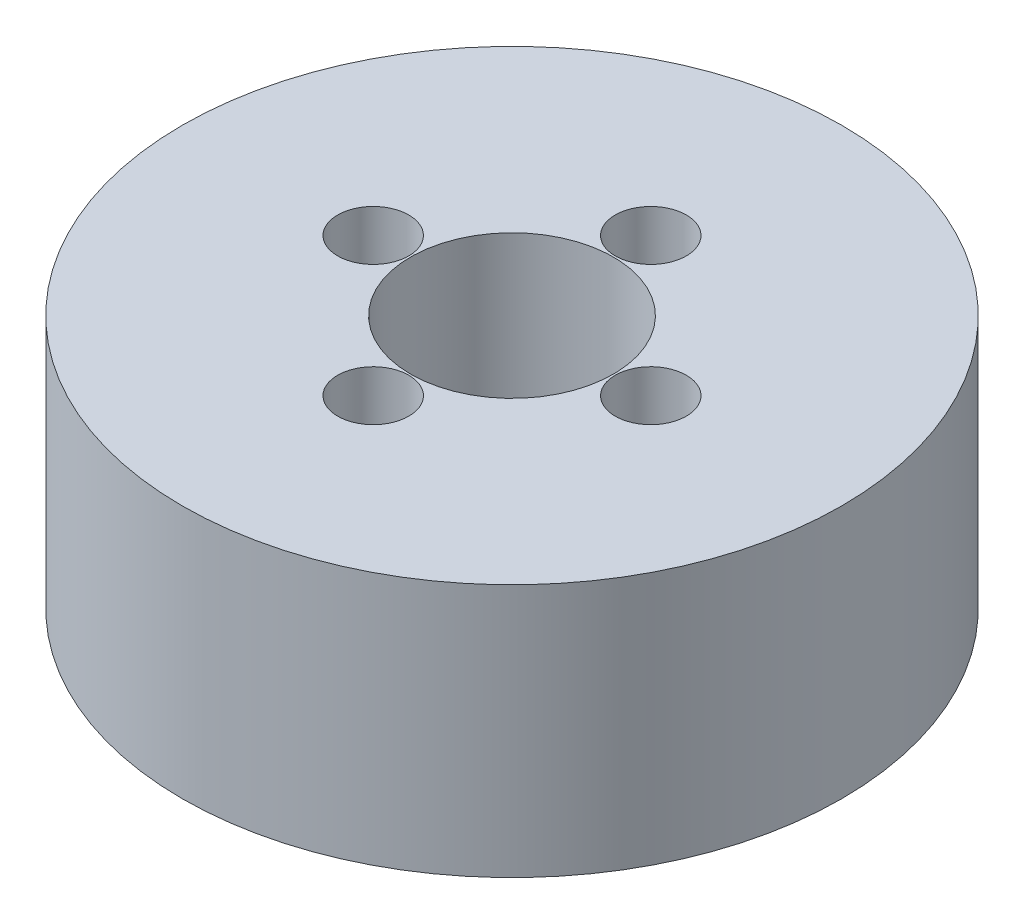
ISO-10303-21;
HEADER;
FILE_DESCRIPTION(('STEP AP214'),'2;1');
FILE_NAME('part.step','',(''),(''),'','','');
FILE_SCHEMA(('AUTOMOTIVE_DESIGN { 1 0 10303 214 1 1 1 1 }'));
ENDSEC;
DATA;
#1=APPLICATION_CONTEXT('core data for automotive mechanical design processes');
#2=APPLICATION_PROTOCOL_DEFINITION('international standard','automotive_design',2000,#1);
#3=PRODUCT_CONTEXT('',#1,'mechanical');
#4=PRODUCT('Part','Part','',(#3));
#5=PRODUCT_RELATED_PRODUCT_CATEGORY('part','',(#4));
#6=PRODUCT_DEFINITION_FORMATION('','',#4);
#7=PRODUCT_DEFINITION_CONTEXT('part definition',#1,'design');
#8=PRODUCT_DEFINITION('design','',#6,#7);
#9=PRODUCT_DEFINITION_SHAPE('','',#8);
#10=(LENGTH_UNIT() NAMED_UNIT(*) SI_UNIT(.MILLI.,.METRE.));
#11=(NAMED_UNIT(*) PLANE_ANGLE_UNIT() SI_UNIT($,.RADIAN.));
#12=(NAMED_UNIT(*) SI_UNIT($,.STERADIAN.) SOLID_ANGLE_UNIT());
#13=UNCERTAINTY_MEASURE_WITH_UNIT(LENGTH_MEASURE(1.E-05),#10,'distance_accuracy_value','');
#14=(GEOMETRIC_REPRESENTATION_CONTEXT(3) GLOBAL_UNCERTAINTY_ASSIGNED_CONTEXT((#13)) GLOBAL_UNIT_ASSIGNED_CONTEXT((#10,
#11,#12)) REPRESENTATION_CONTEXT('',''));
#15=CARTESIAN_POINT('',(0.,0.,0.));
#16=DIRECTION('',(0.,0.,1.));
#17=DIRECTION('',(1.,0.,0.));
#18=AXIS2_PLACEMENT_3D('',#15,#16,#17);
#19=CARTESIAN_POINT('',(0.,25.,0.));
#20=DIRECTION('',(0.,-1.,0.));
#21=DIRECTION('',(0.,0.,-1.));
#22=AXIS2_PLACEMENT_3D('',#19,#20,#21);
#23=CYLINDRICAL_SURFACE('',#22,32.5);
#24=CARTESIAN_POINT('',(0.,25.,0.));
#25=DIRECTION('',(0.,1.,0.));
#26=DIRECTION('',(0.,0.,1.));
#27=AXIS2_PLACEMENT_3D('',#24,#25,#26);
#28=CIRCLE('',#27,32.5);
#29=CARTESIAN_POINT('',(0.,25.,32.5));
#30=VERTEX_POINT('',#29);
#31=EDGE_CURVE('E10',#30,#30,#28,.T.);
#32=ORIENTED_EDGE('',*,*,#31,.F.);
#33=EDGE_LOOP('',(#32));
#34=FACE_BOUND('',#33,.T.);
#35=CARTESIAN_POINT('',(0.,0.,0.));
#36=DIRECTION('',(0.,1.,0.));
#37=DIRECTION('',(0.,0.,1.));
#38=AXIS2_PLACEMENT_3D('',#35,#36,#37);
#39=CIRCLE('',#38,32.5);
#40=CARTESIAN_POINT('',(0.,0.,32.5));
#41=VERTEX_POINT('',#40);
#42=EDGE_CURVE('E37',#41,#41,#39,.T.);
#43=ORIENTED_EDGE('',*,*,#42,.T.);
#44=EDGE_LOOP('',(#43));
#45=FACE_BOUND('',#44,.T.);
#46=ADVANCED_FACE('F40',(#34,#45),#23,.T.);
#47=CARTESIAN_POINT('',(0.,25.,0.));
#48=DIRECTION('',(0.,1.,0.));
#49=DIRECTION('',(0.,0.,1.));
#50=AXIS2_PLACEMENT_3D('',#47,#48,#49);
#51=PLANE('',#50);
#52=CARTESIAN_POINT('',(0.,25.,13.680179401464));
#53=DIRECTION('',(0.,1.,0.));
#54=DIRECTION('',(1.,0.,0.));
#55=AXIS2_PLACEMENT_3D('',#52,#53,#54);
#56=CIRCLE('',#55,3.50239896659175);
#57=CARTESIAN_POINT('',(3.5023989665918,25.,13.680179401464));
#58=VERTEX_POINT('',#57);
#59=EDGE_CURVE('E71',#58,#58,#56,.T.);
#60=ORIENTED_EDGE('',*,*,#59,.F.);
#61=EDGE_LOOP('',(#60));
#62=FACE_BOUND('',#61,.T.);
#63=CARTESIAN_POINT('',(13.680179401464,25.,0.));
#64=DIRECTION('',(0.,1.,0.));
#65=DIRECTION('',(0.,0.,-1.));
#66=AXIS2_PLACEMENT_3D('',#63,#64,#65);
#67=CIRCLE('',#66,3.50239896659175);
#68=CARTESIAN_POINT('',(13.680179401464,25.,-3.50239896659175));
#69=VERTEX_POINT('',#68);
#70=EDGE_CURVE('E70',#69,#69,#67,.T.);
#71=ORIENTED_EDGE('',*,*,#70,.F.);
#72=EDGE_LOOP('',(#71));
#73=FACE_BOUND('',#72,.T.);
#74=CARTESIAN_POINT('',(-1.43292273276713E-13,25.,-13.680179401464));
#75=DIRECTION('',(0.,1.,0.));
#76=DIRECTION('',(-1.,0.,0.));
#77=AXIS2_PLACEMENT_3D('',#74,#75,#76);
#78=CIRCLE('',#77,3.50239896659175);
#79=CARTESIAN_POINT('',(-3.5023989665919,25.,-13.680179401464));
#80=VERTEX_POINT('',#79);
#81=EDGE_CURVE('E61',#80,#80,#78,.T.);
#82=ORIENTED_EDGE('',*,*,#81,.F.);
#83=EDGE_LOOP('',(#82));
#84=FACE_BOUND('',#83,.T.);
#85=CARTESIAN_POINT('',(-13.680179401464,25.,0.));
#86=DIRECTION('',(0.,1.,0.));
#87=DIRECTION('',(0.,0.,1.));
#88=AXIS2_PLACEMENT_3D('',#85,#86,#87);
#89=CIRCLE('',#88,3.50239896659175);
#90=CARTESIAN_POINT('',(-13.680179401464,25.,3.50239896659175));
#91=VERTEX_POINT('',#90);
#92=EDGE_CURVE('E54',#91,#91,#89,.T.);
#93=ORIENTED_EDGE('',*,*,#92,.F.);
#94=EDGE_LOOP('',(#93));
#95=FACE_BOUND('',#94,.T.);
#96=CARTESIAN_POINT('',(0.,25.,0.));
#97=DIRECTION('',(0.,1.,0.));
#98=DIRECTION('',(0.,0.,1.));
#99=AXIS2_PLACEMENT_3D('',#96,#97,#98);
#100=CIRCLE('',#99,10.);
#101=CARTESIAN_POINT('',(0.,25.,10.));
#102=VERTEX_POINT('',#101);
#103=EDGE_CURVE('E50',#102,#102,#100,.T.);
#104=ORIENTED_EDGE('',*,*,#103,.F.);
#105=EDGE_LOOP('',(#104));
#106=FACE_BOUND('',#105,.T.);
#107=ORIENTED_EDGE('',*,*,#31,.T.);
#108=EDGE_LOOP('',(#107));
#109=FACE_BOUND('',#108,.T.);
#110=ADVANCED_FACE('F86',(#62,#73,#84,#95,#106,#109),#51,.T.);
#111=CARTESIAN_POINT('',(0.,0.,0.));
#112=DIRECTION('',(0.,1.,0.));
#113=DIRECTION('',(0.,0.,1.));
#114=AXIS2_PLACEMENT_3D('',#111,#112,#113);
#115=PLANE('',#114);
#116=CARTESIAN_POINT('',(0.,0.,0.));
#117=DIRECTION('',(0.,1.,0.));
#118=DIRECTION('',(0.,0.,1.));
#119=AXIS2_PLACEMENT_3D('',#116,#117,#118);
#120=CIRCLE('',#119,10.);
#121=CARTESIAN_POINT('',(0.,0.,10.));
#122=VERTEX_POINT('',#121);
#123=EDGE_CURVE('E47',#122,#122,#120,.T.);
#124=ORIENTED_EDGE('',*,*,#123,.T.);
#125=EDGE_LOOP('',(#124));
#126=FACE_BOUND('',#125,.T.);
#127=ORIENTED_EDGE('',*,*,#42,.F.);
#128=EDGE_LOOP('',(#127));
#129=FACE_BOUND('',#128,.T.);
#130=ADVANCED_FACE('F93',(#126,#129),#115,.F.);
#131=CARTESIAN_POINT('',(0.,25.,0.));
#132=DIRECTION('',(0.,-1.,0.));
#133=DIRECTION('',(0.,0.,-1.));
#134=AXIS2_PLACEMENT_3D('',#131,#132,#133);
#135=CYLINDRICAL_SURFACE('',#134,10.);
#136=ORIENTED_EDGE('',*,*,#103,.T.);
#137=EDGE_LOOP('',(#136));
#138=FACE_BOUND('',#137,.T.);
#139=ORIENTED_EDGE('',*,*,#123,.F.);
#140=EDGE_LOOP('',(#139));
#141=FACE_BOUND('',#140,.T.);
#142=ADVANCED_FACE('F101',(#138,#141),#135,.F.);
#143=CARTESIAN_POINT('',(-13.680179401464,2.02519025294096,0.));
#144=DIRECTION('',(0.,1.,0.));
#145=DIRECTION('',(0.,0.,1.));
#146=AXIS2_PLACEMENT_3D('',#143,#144,#145);
#147=CYLINDRICAL_SURFACE('',#146,3.50239896659175);
#148=CARTESIAN_POINT('',(-13.680179401464,2.02519025294096,0.));
#149=DIRECTION('',(0.,1.,0.));
#150=DIRECTION('',(0.,0.,1.));
#151=AXIS2_PLACEMENT_3D('',#148,#149,#150);
#152=CIRCLE('',#151,3.50239896659175);
#153=CARTESIAN_POINT('',(-13.680179401464,2.02519025294096,3.50239896659175));
#154=VERTEX_POINT('',#153);
#155=EDGE_CURVE('E55',#154,#154,#152,.T.);
#156=ORIENTED_EDGE('',*,*,#155,.F.);
#157=EDGE_LOOP('',(#156));
#158=FACE_BOUND('',#157,.T.);
#159=ORIENTED_EDGE('',*,*,#92,.T.);
#160=EDGE_LOOP('',(#159));
#161=FACE_BOUND('',#160,.T.);
#162=ADVANCED_FACE('F102',(#158,#161),#147,.F.);
#163=CARTESIAN_POINT('',(-13.680179401464,2.02519025294096,0.));
#164=DIRECTION('',(0.,1.,0.));
#165=DIRECTION('',(0.,0.,1.));
#166=AXIS2_PLACEMENT_3D('',#163,#164,#165);
#167=PLANE('',#166);
#168=ORIENTED_EDGE('',*,*,#155,.T.);
#169=EDGE_LOOP('',(#168));
#170=FACE_BOUND('',#169,.T.);
#171=ADVANCED_FACE('F133',(#170),#167,.T.);
#172=CARTESIAN_POINT('',(-1.43292273276713E-13,2.02519025294096,-13.680179401464));
#173=DIRECTION('',(0.,1.,0.));
#174=DIRECTION('',(0.,0.,1.));
#175=AXIS2_PLACEMENT_3D('',#172,#173,#174);
#176=CYLINDRICAL_SURFACE('',#175,3.50239896659175);
#177=CARTESIAN_POINT('',(-1.43292273276713E-13,2.02519025294096,-13.680179401464));
#178=DIRECTION('',(0.,1.,0.));
#179=DIRECTION('',(-1.,0.,0.));
#180=AXIS2_PLACEMENT_3D('',#177,#178,#179);
#181=CIRCLE('',#180,3.50239896659175);
#182=CARTESIAN_POINT('',(-3.5023989665919,2.02519025294096,-13.680179401464));
#183=VERTEX_POINT('',#182);
#184=EDGE_CURVE('E63',#183,#183,#181,.T.);
#185=ORIENTED_EDGE('',*,*,#184,.F.);
#186=EDGE_LOOP('',(#185));
#187=FACE_BOUND('',#186,.T.);
#188=ORIENTED_EDGE('',*,*,#81,.T.);
#189=EDGE_LOOP('',(#188));
#190=FACE_BOUND('',#189,.T.);
#191=ADVANCED_FACE('F142',(#187,#190),#176,.F.);
#192=CARTESIAN_POINT('',(-1.43292273276713E-13,2.02519025294096,-13.680179401464));
#193=DIRECTION('',(0.,1.,0.));
#194=DIRECTION('',(-1.,0.,0.));
#195=AXIS2_PLACEMENT_3D('',#192,#193,#194);
#196=PLANE('',#195);
#197=ORIENTED_EDGE('',*,*,#184,.T.);
#198=EDGE_LOOP('',(#197));
#199=FACE_BOUND('',#198,.T.);
#200=ADVANCED_FACE('F156',(#199),#196,.T.);
#201=CARTESIAN_POINT('',(13.680179401464,2.02519025294096,0.));
#202=DIRECTION('',(0.,1.,0.));
#203=DIRECTION('',(0.,0.,1.));
#204=AXIS2_PLACEMENT_3D('',#201,#202,#203);
#205=CYLINDRICAL_SURFACE('',#204,3.50239896659175);
#206=CARTESIAN_POINT('',(13.680179401464,2.02519025294096,0.));
#207=DIRECTION('',(0.,1.,0.));
#208=DIRECTION('',(0.,0.,-1.));
#209=AXIS2_PLACEMENT_3D('',#206,#207,#208);
#210=CIRCLE('',#209,3.50239896659175);
#211=CARTESIAN_POINT('',(13.680179401464,2.02519025294096,-3.50239896659175));
#212=VERTEX_POINT('',#211);
#213=EDGE_CURVE('E69',#212,#212,#210,.T.);
#214=ORIENTED_EDGE('',*,*,#213,.F.);
#215=EDGE_LOOP('',(#214));
#216=FACE_BOUND('',#215,.T.);
#217=ORIENTED_EDGE('',*,*,#70,.T.);
#218=EDGE_LOOP('',(#217));
#219=FACE_BOUND('',#218,.T.);
#220=ADVANCED_FACE('F164',(#216,#219),#205,.F.);
#221=CARTESIAN_POINT('',(13.680179401464,2.02519025294096,0.));
#222=DIRECTION('',(0.,1.,0.));
#223=DIRECTION('',(0.,0.,-1.));
#224=AXIS2_PLACEMENT_3D('',#221,#222,#223);
#225=PLANE('',#224);
#226=ORIENTED_EDGE('',*,*,#213,.T.);
#227=EDGE_LOOP('',(#226));
#228=FACE_BOUND('',#227,.T.);
#229=ADVANCED_FACE('F83',(#228),#225,.T.);
#230=CARTESIAN_POINT('',(0.,2.02519025294096,13.680179401464));
#231=DIRECTION('',(0.,1.,0.));
#232=DIRECTION('',(0.,0.,1.));
#233=AXIS2_PLACEMENT_3D('',#230,#231,#232);
#234=CYLINDRICAL_SURFACE('',#233,3.50239896659175);
#235=CARTESIAN_POINT('',(0.,2.02519025294096,13.680179401464));
#236=DIRECTION('',(0.,1.,0.));
#237=DIRECTION('',(1.,0.,0.));
#238=AXIS2_PLACEMENT_3D('',#235,#236,#237);
#239=CIRCLE('',#238,3.50239896659175);
#240=CARTESIAN_POINT('',(3.5023989665918,2.02519025294096,13.680179401464));
#241=VERTEX_POINT('',#240);
#242=EDGE_CURVE('E59',#241,#241,#239,.T.);
#243=ORIENTED_EDGE('',*,*,#242,.F.);
#244=EDGE_LOOP('',(#243));
#245=FACE_BOUND('',#244,.T.);
#246=ORIENTED_EDGE('',*,*,#59,.T.);
#247=EDGE_LOOP('',(#246));
#248=FACE_BOUND('',#247,.T.);
#249=ADVANCED_FACE('F81',(#245,#248),#234,.F.);
#250=CARTESIAN_POINT('',(0.,2.02519025294096,13.680179401464));
#251=DIRECTION('',(0.,1.,0.));
#252=DIRECTION('',(1.,0.,0.));
#253=AXIS2_PLACEMENT_3D('',#250,#251,#252);
#254=PLANE('',#253);
#255=ORIENTED_EDGE('',*,*,#242,.T.);
#256=EDGE_LOOP('',(#255));
#257=FACE_BOUND('',#256,.T.);
#258=ADVANCED_FACE('F78',(#257),#254,.T.);
#259=CLOSED_SHELL('',(#46,#110,#130,#142,#162,#171,#191,#200,#220,#229,#249,#258));
#260=MANIFOLD_SOLID_BREP('B2',#259);
#261=ADVANCED_BREP_SHAPE_REPRESENTATION('',(#18,#260),#14);
#262=SHAPE_DEFINITION_REPRESENTATION(#9,#261);
ENDSEC;
END-ISO-10303-21;
